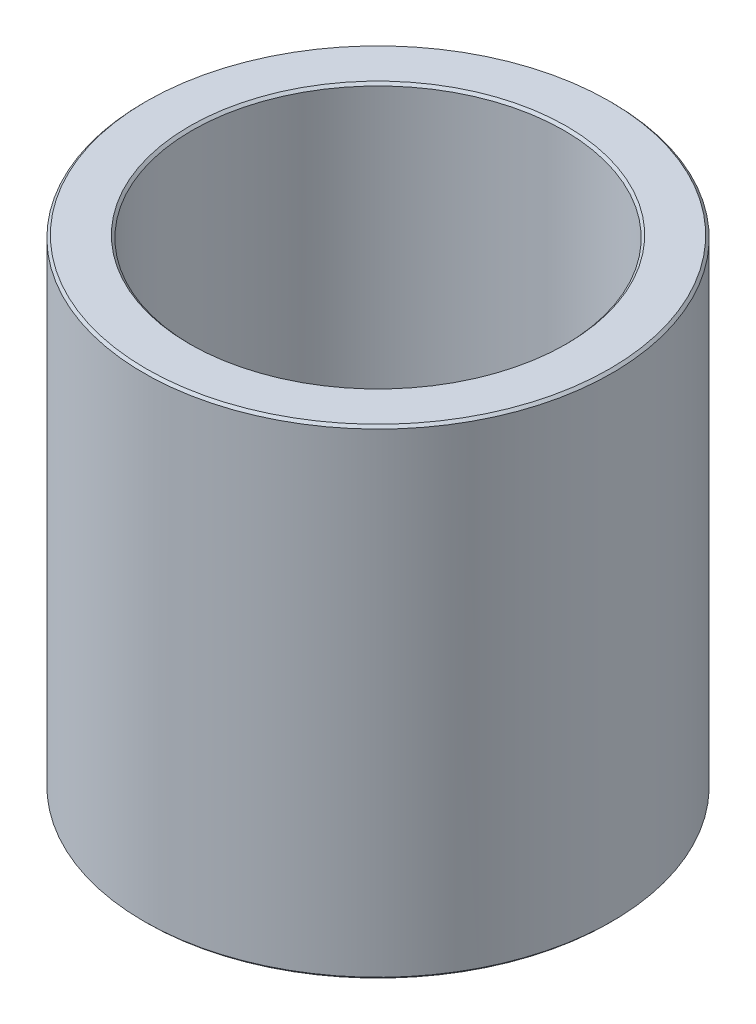
ISO-10303-21;
HEADER;
FILE_DESCRIPTION(('STEP AP214'),'2;1');
FILE_NAME('part.step','',(''),(''),'','','');
FILE_SCHEMA(('AUTOMOTIVE_DESIGN { 1 0 10303 214 1 1 1 1 }'));
ENDSEC;
DATA;
#1=APPLICATION_CONTEXT('core data for automotive mechanical design processes');
#2=APPLICATION_PROTOCOL_DEFINITION('international standard','automotive_design',2000,#1);
#3=PRODUCT_CONTEXT('',#1,'mechanical');
#4=PRODUCT('Part','Part','',(#3));
#5=PRODUCT_RELATED_PRODUCT_CATEGORY('part','',(#4));
#6=PRODUCT_DEFINITION_FORMATION('','',#4);
#7=PRODUCT_DEFINITION_CONTEXT('part definition',#1,'design');
#8=PRODUCT_DEFINITION('design','',#6,#7);
#9=PRODUCT_DEFINITION_SHAPE('','',#8);
#10=(LENGTH_UNIT() NAMED_UNIT(*) SI_UNIT(.MILLI.,.METRE.));
#11=(NAMED_UNIT(*) PLANE_ANGLE_UNIT() SI_UNIT($,.RADIAN.));
#12=(NAMED_UNIT(*) SI_UNIT($,.STERADIAN.) SOLID_ANGLE_UNIT());
#13=UNCERTAINTY_MEASURE_WITH_UNIT(LENGTH_MEASURE(1.E-05),#10,'distance_accuracy_value','');
#14=(GEOMETRIC_REPRESENTATION_CONTEXT(3) GLOBAL_UNCERTAINTY_ASSIGNED_CONTEXT((#13)) GLOBAL_UNIT_ASSIGNED_CONTEXT((#10,
#11,#12)) REPRESENTATION_CONTEXT('',''));
#15=CARTESIAN_POINT('',(0.,0.,0.));
#16=DIRECTION('',(0.,0.,1.));
#17=DIRECTION('',(1.,0.,0.));
#18=AXIS2_PLACEMENT_3D('',#15,#16,#17);
#19=CARTESIAN_POINT('',(0.,107.535181572289,0.));
#20=DIRECTION('',(0.,-1.,0.));
#21=DIRECTION('',(0.,0.,-1.));
#22=AXIS2_PLACEMENT_3D('',#19,#20,#21);
#23=CYLINDRICAL_SURFACE('',#22,52.5);
#24=CARTESIAN_POINT('',(0.,0.553045640529493,0.));
#25=DIRECTION('',(0.,1.,0.));
#26=DIRECTION('',(0.,0.,1.));
#27=AXIS2_PLACEMENT_3D('',#24,#25,#26);
#28=CIRCLE('',#27,52.5);
#29=CARTESIAN_POINT('',(0.,0.553045640529493,-52.5));
#30=VERTEX_POINT('',#29);
#31=EDGE_CURVE('E10',#30,#30,#28,.T.);
#32=CARTESIAN_POINT('',(0.,106.982135931759,0.));
#33=DIRECTION('',(0.,1.,0.));
#34=DIRECTION('',(0.,0.,1.));
#35=AXIS2_PLACEMENT_3D('',#32,#33,#34);
#36=CIRCLE('',#35,52.5);
#37=CARTESIAN_POINT('',(0.,106.982135931759,-52.5));
#38=VERTEX_POINT('',#37);
#39=EDGE_CURVE('E50',#38,#38,#36,.F.);
#40=CARTESIAN_POINT('',(0.,0.553045640529493,-52.5));
#41=CARTESIAN_POINT('',(0.,1.66168199772981,-52.5));
#42=CARTESIAN_POINT('',(0.,2.77031835493012,-52.5));
#43=CARTESIAN_POINT('',(0.,4.98759106933074,-52.5));
#44=CARTESIAN_POINT('',(0.,6.09622742653104,-52.5));
#45=CARTESIAN_POINT('',(0.,8.31350014093166,-52.5));
#46=CARTESIAN_POINT('',(0.,9.42213649813196,-52.5));
#47=CARTESIAN_POINT('',(0.,11.6394092125326,-52.5));
#48=CARTESIAN_POINT('',(0.,12.7480455697329,-52.5));
#49=CARTESIAN_POINT('',(0.,14.9653182841335,-52.5));
#50=CARTESIAN_POINT('',(0.,16.0739546413338,-52.5));
#51=CARTESIAN_POINT('',(0.,18.2912273557344,-52.5));
#52=CARTESIAN_POINT('',(0.,19.3998637129348,-52.5));
#53=CARTESIAN_POINT('',(0.,21.6171364273354,-52.5));
#54=CARTESIAN_POINT('',(0.,22.7257727845357,-52.5));
#55=CARTESIAN_POINT('',(0.,24.9430454989363,-52.5));
#56=CARTESIAN_POINT('',(0.,26.0516818561366,-52.5));
#57=CARTESIAN_POINT('',(0.,28.2689545705372,-52.5));
#58=CARTESIAN_POINT('',(0.,29.3775909277375,-52.5));
#59=CARTESIAN_POINT('',(0.,31.5948636421382,-52.5));
#60=CARTESIAN_POINT('',(0.,32.7034999993385,-52.5));
#61=CARTESIAN_POINT('',(0.,34.9207727137391,-52.5));
#62=CARTESIAN_POINT('',(0.,36.0294090709394,-52.5));
#63=CARTESIAN_POINT('',(0.,38.24668178534,-52.5));
#64=CARTESIAN_POINT('',(0.,39.3553181425403,-52.5));
#65=CARTESIAN_POINT('',(0.,41.5725908569409,-52.5));
#66=CARTESIAN_POINT('',(0.,42.6812272141413,-52.5));
#67=CARTESIAN_POINT('',(0.,44.8984999285419,-52.5));
#68=CARTESIAN_POINT('',(0.,46.0071362857422,-52.5));
#69=CARTESIAN_POINT('',(0.,48.2244090001428,-52.5));
#70=CARTESIAN_POINT('',(0.,49.3330453573431,-52.5));
#71=CARTESIAN_POINT('',(0.,51.5503180717437,-52.5));
#72=CARTESIAN_POINT('',(0.,52.658954428944,-52.5));
#73=CARTESIAN_POINT('',(0.,54.8762271433447,-52.5));
#74=CARTESIAN_POINT('',(0.,55.984863500545,-52.5));
#75=CARTESIAN_POINT('',(0.,58.2021362149456,-52.5));
#76=CARTESIAN_POINT('',(0.,59.3107725721459,-52.5));
#77=CARTESIAN_POINT('',(0.,61.5280452865465,-52.5));
#78=CARTESIAN_POINT('',(0.,62.6366816437468,-52.5));
#79=CARTESIAN_POINT('',(0.,64.8539543581474,-52.5));
#80=CARTESIAN_POINT('',(0.,65.9625907153478,-52.5));
#81=CARTESIAN_POINT('',(0.,68.1798634297484,-52.5));
#82=CARTESIAN_POINT('',(0.,69.2884997869487,-52.5));
#83=CARTESIAN_POINT('',(0.,71.5057725013493,-52.5));
#84=CARTESIAN_POINT('',(0.,72.6144088585496,-52.5));
#85=CARTESIAN_POINT('',(0.,74.8316815729502,-52.5));
#86=CARTESIAN_POINT('',(0.,75.9403179301505,-52.5));
#87=CARTESIAN_POINT('',(0.,78.1575906445511,-52.5));
#88=CARTESIAN_POINT('',(0.,79.2662270017515,-52.5));
#89=CARTESIAN_POINT('',(0.,81.4834997161521,-52.5));
#90=CARTESIAN_POINT('',(0.,82.5921360733524,-52.5));
#91=CARTESIAN_POINT('',(0.,84.809408787753,-52.5));
#92=CARTESIAN_POINT('',(0.,85.9180451449533,-52.5));
#93=CARTESIAN_POINT('',(0.,88.1353178593539,-52.5));
#94=CARTESIAN_POINT('',(0.,89.2439542165542,-52.5));
#95=CARTESIAN_POINT('',(0.,91.4612269309549,-52.5));
#96=CARTESIAN_POINT('',(0.,92.5698632881552,-52.5));
#97=CARTESIAN_POINT('',(0.,94.7871360025558,-52.5));
#98=CARTESIAN_POINT('',(0.,95.8957723597561,-52.5));
#99=CARTESIAN_POINT('',(0.,98.1130450741567,-52.5));
#100=CARTESIAN_POINT('',(0.,99.221681431357,-52.5));
#101=CARTESIAN_POINT('',(0.,101.438954145758,-52.5));
#102=CARTESIAN_POINT('',(0.,102.547590502958,-52.5));
#103=CARTESIAN_POINT('',(0.,104.764863217359,-52.5));
#104=CARTESIAN_POINT('',(0.,105.873499574559,-52.5));
#105=CARTESIAN_POINT('',(0.,106.982135931759,-52.5));
#106=B_SPLINE_CURVE_WITH_KNOTS('',3,(#40,#41,#42,#43,#44,#45,#46,#47,#48,#49,#50,#51,#52,#53,
#54,#55,#56,#57,#58,#59,#60,#61,#62,#63,#64,#65,#66,#67,#68,#69,#70,#71,#72,#73,#74,#75,#76,#77,
#78,#79,#80,#81,#82,#83,#84,#85,#86,#87,#88,#89,#90,#91,#92,#93,#94,#95,#96,#97,#98,#99,#100,
#101,#102,#103,#104,#105),.UNSPECIFIED.,.F.,.F.,(4,2,2,2,2,2,2,2,2,2,2,2,2,2,2,2,2,2,2,2,2,2,2,
2,2,2,2,2,2,2,2,2,4),(0.,3.32590907160094,6.65181814320186,9.97772721480278,13.3036362864037,
16.6295453580046,19.9554544296056,23.2813635012065,26.6072725728074,29.9331816444084,
33.2590907160093,36.5849997876102,39.9109088592111,43.2368179308121,46.562727002413,
49.8886360740139,53.2145451456148,56.5404542172158,59.8663632888167,63.1922723604176,
66.5181814320186,69.8440905036195,73.1699995752204,76.4959086468213,79.8218177184223,
83.1477267900232,86.4736358616241,89.7995449332251,93.125454004826,96.4513630764269,
99.7772721480278,103.103181219629,106.42909029123),.UNSPECIFIED.);
#107=EDGE_CURVE('BSEAM39',#30,#38,#106,.T.);
#108=ORIENTED_EDGE('',*,*,#31,.T.);
#109=ORIENTED_EDGE('',*,*,#39,.T.);
#110=ORIENTED_EDGE('',*,*,#107,.T.);
#111=ORIENTED_EDGE('',*,*,#107,.F.);
#112=EDGE_LOOP('',(#108,#110,#109,#111));
#113=FACE_BOUND('',#112,.T.);
#114=ADVANCED_FACE('F39',(#113),#23,.T.);
#115=CARTESIAN_POINT('',(0.,107.535181572289,0.));
#116=DIRECTION('',(0.,1.,0.));
#117=DIRECTION('',(0.,0.,1.));
#118=AXIS2_PLACEMENT_3D('',#115,#116,#117);
#119=PLANE('',#118);
#120=CARTESIAN_POINT('',(0.,107.535181572289,0.));
#121=DIRECTION('',(0.,1.,0.));
#122=DIRECTION('',(0.,0.,1.));
#123=AXIS2_PLACEMENT_3D('',#120,#121,#122);
#124=CIRCLE('',#123,42.2751699766673);
#125=CARTESIAN_POINT('',(0.,107.535181572289,42.2751699766673));
#126=VERTEX_POINT('',#125);
#127=EDGE_CURVE('E58',#126,#126,#124,.F.);
#128=ORIENTED_EDGE('',*,*,#127,.T.);
#129=EDGE_LOOP('',(#128));
#130=FACE_BOUND('',#129,.T.);
#131=CARTESIAN_POINT('',(0.,107.535181572289,0.));
#132=DIRECTION('',(0.,1.,0.));
#133=DIRECTION('',(0.,0.,1.));
#134=AXIS2_PLACEMENT_3D('',#131,#132,#133);
#135=CIRCLE('',#134,51.9469543594707);
#136=CARTESIAN_POINT('',(0.,107.535181572289,51.9469543594707));
#137=VERTEX_POINT('',#136);
#138=EDGE_CURVE('E61',#137,#137,#135,.T.);
#139=ORIENTED_EDGE('',*,*,#138,.T.);
#140=EDGE_LOOP('',(#139));
#141=FACE_BOUND('',#140,.T.);
#142=ADVANCED_FACE('F88',(#130,#141),#119,.T.);
#143=CARTESIAN_POINT('',(0.,0.,0.));
#144=DIRECTION('',(0.,1.,0.));
#145=DIRECTION('',(0.,0.,1.));
#146=AXIS2_PLACEMENT_3D('',#143,#144,#145);
#147=PLANE('',#146);
#148=CARTESIAN_POINT('',(0.,0.,0.));
#149=DIRECTION('',(0.,1.,0.));
#150=DIRECTION('',(0.,0.,1.));
#151=AXIS2_PLACEMENT_3D('',#148,#149,#150);
#152=CIRCLE('',#151,42.2751699766672);
#153=CARTESIAN_POINT('',(0.,0.,42.2751699766672));
#154=VERTEX_POINT('',#153);
#155=EDGE_CURVE('E51',#154,#154,#152,.T.);
#156=ORIENTED_EDGE('',*,*,#155,.T.);
#157=EDGE_LOOP('',(#156));
#158=FACE_BOUND('',#157,.T.);
#159=CARTESIAN_POINT('',(0.,0.,0.));
#160=DIRECTION('',(0.,1.,0.));
#161=DIRECTION('',(0.,0.,1.));
#162=AXIS2_PLACEMENT_3D('',#159,#160,#161);
#163=CIRCLE('',#162,51.9469543594705);
#164=CARTESIAN_POINT('',(0.,0.,51.9469543594705));
#165=VERTEX_POINT('',#164);
#166=EDGE_CURVE('E54',#165,#165,#163,.F.);
#167=ORIENTED_EDGE('',*,*,#166,.T.);
#168=EDGE_LOOP('',(#167));
#169=FACE_BOUND('',#168,.T.);
#170=ADVANCED_FACE('F83',(#158,#169),#147,.F.);
#171=CARTESIAN_POINT('',(0.,107.535181572289,0.));
#172=DIRECTION('',(0.,-1.,0.));
#173=DIRECTION('',(0.,0.,-1.));
#174=AXIS2_PLACEMENT_3D('',#171,#172,#173);
#175=CYLINDRICAL_SURFACE('',#174,41.7221243361379);
#176=CARTESIAN_POINT('',(0.,106.982135931759,0.));
#177=DIRECTION('',(0.,1.,0.));
#178=DIRECTION('',(0.,0.,1.));
#179=AXIS2_PLACEMENT_3D('',#176,#177,#178);
#180=CIRCLE('',#179,41.7221243361379);
#181=CARTESIAN_POINT('',(0.,106.982135931759,-41.7221243361379));
#182=VERTEX_POINT('',#181);
#183=EDGE_CURVE('E67',#182,#182,#180,.T.);
#184=CARTESIAN_POINT('',(0.,0.553045640529312,0.));
#185=DIRECTION('',(0.,1.,0.));
#186=DIRECTION('',(0.,0.,1.));
#187=AXIS2_PLACEMENT_3D('',#184,#185,#186);
#188=CIRCLE('',#187,41.7221243361379);
#189=CARTESIAN_POINT('',(0.,0.553045640529298,-41.7221243361379));
#190=VERTEX_POINT('',#189);
#191=EDGE_CURVE('E69',#190,#190,#188,.F.);
#192=CARTESIAN_POINT('',(0.,106.982135931759,-41.7221243361379));
#193=CARTESIAN_POINT('',(0.,105.873499574559,-41.7221243361379));
#194=CARTESIAN_POINT('',(0.,104.764863217358,-41.7221243361379));
#195=CARTESIAN_POINT('',(0.,102.547590502958,-41.7221243361379));
#196=CARTESIAN_POINT('',(0.,101.438954145757,-41.7221243361379));
#197=CARTESIAN_POINT('',(0.,99.2216814313569,-41.7221243361379));
#198=CARTESIAN_POINT('',(0.,98.1130450741566,-41.7221243361379));
#199=CARTESIAN_POINT('',(0.,95.895772359756,-41.7221243361379));
#200=CARTESIAN_POINT('',(0.,94.7871360025556,-41.7221243361379));
#201=CARTESIAN_POINT('',(0.,92.569863288155,-41.7221243361379));
#202=CARTESIAN_POINT('',(0.,91.4612269309547,-41.7221243361379));
#203=CARTESIAN_POINT('',(0.,89.2439542165541,-41.7221243361379));
#204=CARTESIAN_POINT('',(0.,88.1353178593538,-41.7221243361379));
#205=CARTESIAN_POINT('',(0.,85.9180451449532,-41.7221243361379));
#206=CARTESIAN_POINT('',(0.,84.8094087877528,-41.7221243361379));
#207=CARTESIAN_POINT('',(0.,82.5921360733522,-41.7221243361379));
#208=CARTESIAN_POINT('',(0.,81.4834997161519,-41.7221243361379));
#209=CARTESIAN_POINT('',(0.,79.2662270017513,-41.7221243361379));
#210=CARTESIAN_POINT('',(0.,78.157590644551,-41.7221243361379));
#211=CARTESIAN_POINT('',(0.,75.9403179301504,-41.7221243361379));
#212=CARTESIAN_POINT('',(0.,74.8316815729501,-41.7221243361379));
#213=CARTESIAN_POINT('',(0.,72.6144088585494,-41.7221243361379));
#214=CARTESIAN_POINT('',(0.,71.5057725013491,-41.7221243361379));
#215=CARTESIAN_POINT('',(0.,69.2884997869485,-41.7221243361379));
#216=CARTESIAN_POINT('',(0.,68.1798634297482,-41.7221243361379));
#217=CARTESIAN_POINT('',(0.,65.9625907153476,-41.7221243361379));
#218=CARTESIAN_POINT('',(0.,64.8539543581473,-41.7221243361379));
#219=CARTESIAN_POINT('',(0.,62.6366816437467,-41.7221243361379));
#220=CARTESIAN_POINT('',(0.,61.5280452865463,-41.7221243361379));
#221=CARTESIAN_POINT('',(0.,59.3107725721457,-41.7221243361379));
#222=CARTESIAN_POINT('',(0.,58.2021362149454,-41.7221243361379));
#223=CARTESIAN_POINT('',(0.,55.9848635005448,-41.7221243361379));
#224=CARTESIAN_POINT('',(0.,54.8762271433445,-41.7221243361379));
#225=CARTESIAN_POINT('',(0.,52.6589544289439,-41.7221243361379));
#226=CARTESIAN_POINT('',(0.,51.5503180717435,-41.7221243361379));
#227=CARTESIAN_POINT('',(0.,49.3330453573429,-41.7221243361379));
#228=CARTESIAN_POINT('',(0.,48.2244090001426,-41.7221243361379));
#229=CARTESIAN_POINT('',(0.,46.007136285742,-41.7221243361379));
#230=CARTESIAN_POINT('',(0.,44.8984999285417,-41.7221243361379));
#231=CARTESIAN_POINT('',(0.,42.6812272141411,-41.7221243361379));
#232=CARTESIAN_POINT('',(0.,41.5725908569408,-41.7221243361379));
#233=CARTESIAN_POINT('',(0.,39.3553181425402,-41.7221243361379));
#234=CARTESIAN_POINT('',(0.,38.2466817853398,-41.7221243361379));
#235=CARTESIAN_POINT('',(0.,36.0294090709392,-41.7221243361379));
#236=CARTESIAN_POINT('',(0.,34.9207727137389,-41.7221243361379));
#237=CARTESIAN_POINT('',(0.,32.7034999993383,-41.7221243361379));
#238=CARTESIAN_POINT('',(0.,31.594863642138,-41.7221243361379));
#239=CARTESIAN_POINT('',(0.,29.3775909277374,-41.7221243361379));
#240=CARTESIAN_POINT('',(0.,28.268954570537,-41.7221243361379));
#241=CARTESIAN_POINT('',(0.,26.0516818561364,-41.7221243361379));
#242=CARTESIAN_POINT('',(0.,24.9430454989361,-41.7221243361379));
#243=CARTESIAN_POINT('',(0.,22.7257727845355,-41.7221243361379));
#244=CARTESIAN_POINT('',(0.,21.6171364273352,-41.7221243361379));
#245=CARTESIAN_POINT('',(0.,19.3998637129346,-41.7221243361379));
#246=CARTESIAN_POINT('',(0.,18.2912273557343,-41.7221243361379));
#247=CARTESIAN_POINT('',(0.,16.0739546413336,-41.7221243361379));
#248=CARTESIAN_POINT('',(0.,14.9653182841333,-41.7221243361379));
#249=CARTESIAN_POINT('',(0.,12.7480455697327,-41.7221243361379));
#250=CARTESIAN_POINT('',(0.,11.6394092125324,-41.7221243361379));
#251=CARTESIAN_POINT('',(0.,9.42213649813177,-41.7221243361379));
#252=CARTESIAN_POINT('',(0.,8.31350014093145,-41.7221243361379));
#253=CARTESIAN_POINT('',(0.,6.09622742653084,-41.7221243361379));
#254=CARTESIAN_POINT('',(0.,4.98759106933054,-41.7221243361379));
#255=CARTESIAN_POINT('',(0.,2.77031835492992,-41.7221243361379));
#256=CARTESIAN_POINT('',(0.,1.66168199772961,-41.7221243361379));
#257=CARTESIAN_POINT('',(0.,0.553045640529298,-41.7221243361379));
#258=B_SPLINE_CURVE_WITH_KNOTS('',3,(#192,#193,#194,#195,#196,#197,#198,#199,#200,#201,#202,
#203,#204,#205,#206,#207,#208,#209,#210,#211,#212,#213,#214,#215,#216,#217,#218,#219,#220,#221,
#222,#223,#224,#225,#226,#227,#228,#229,#230,#231,#232,#233,#234,#235,#236,#237,#238,#239,#240,
#241,#242,#243,#244,#245,#246,#247,#248,#249,#250,#251,#252,#253,#254,#255,#256,#257),
.UNSPECIFIED.,.F.,.F.,(4,2,2,2,2,2,2,2,2,2,2,2,2,2,2,2,2,2,2,2,2,2,2,2,2,2,2,2,2,2,2,2,4),(0.,
3.32590907160094,6.65181814320187,9.97772721480279,13.3036362864037,16.6295453580046,
19.9554544296056,23.2813635012065,26.6072725728074,29.9331816444084,33.2590907160093,
36.5849997876102,39.9109088592112,43.2368179308121,46.562727002413,49.888636074014,
53.2145451456149,56.5404542172158,59.8663632888167,63.1922723604177,66.5181814320186,
69.8440905036195,73.1699995752205,76.4959086468214,79.8218177184223,83.1477267900233,
86.4736358616242,89.7995449332251,93.125454004826,96.451363076427,99.7772721480279,
103.103181219629,106.42909029123),.UNSPECIFIED.);
#259=EDGE_CURVE('BSEAM71',#182,#190,#258,.T.);
#260=ORIENTED_EDGE('',*,*,#183,.T.);
#261=ORIENTED_EDGE('',*,*,#191,.T.);
#262=ORIENTED_EDGE('',*,*,#259,.T.);
#263=ORIENTED_EDGE('',*,*,#259,.F.);
#264=EDGE_LOOP('',(#260,#262,#261,#263));
#265=FACE_BOUND('',#264,.T.);
#266=ADVANCED_FACE('F71',(#265),#175,.F.);
#267=CARTESIAN_POINT('',(0.,106.982135931759,0.));
#268=DIRECTION('',(0.,1.,0.));
#269=DIRECTION('',(0.,0.,1.));
#270=AXIS2_PLACEMENT_3D('',#267,#268,#269);
#271=CONICAL_SURFACE('',#270,41.7221243361379,0.785398163397455);
#272=ORIENTED_EDGE('',*,*,#127,.F.);
#273=EDGE_LOOP('',(#272));
#274=FACE_BOUND('',#273,.T.);
#275=ORIENTED_EDGE('',*,*,#183,.F.);
#276=EDGE_LOOP('',(#275));
#277=FACE_BOUND('',#276,.T.);
#278=ADVANCED_FACE('F77',(#274,#277),#271,.F.);
#279=CARTESIAN_POINT('',(0.,0.,0.));
#280=DIRECTION('',(0.,-1.,0.));
#281=DIRECTION('',(0.,0.,-1.));
#282=AXIS2_PLACEMENT_3D('',#279,#280,#281);
#283=CONICAL_SURFACE('',#282,42.2751699766672,0.785398163397455);
#284=ORIENTED_EDGE('',*,*,#191,.F.);
#285=EDGE_LOOP('',(#284));
#286=FACE_BOUND('',#285,.T.);
#287=ORIENTED_EDGE('',*,*,#155,.F.);
#288=EDGE_LOOP('',(#287));
#289=FACE_BOUND('',#288,.T.);
#290=ADVANCED_FACE('F73',(#286,#289),#283,.F.);
#291=CARTESIAN_POINT('',(0.,0.553045640529493,0.));
#292=DIRECTION('',(0.,1.,0.));
#293=DIRECTION('',(0.,0.,1.));
#294=AXIS2_PLACEMENT_3D('',#291,#292,#293);
#295=CONICAL_SURFACE('',#294,52.5,0.785398163397455);
#296=ORIENTED_EDGE('',*,*,#166,.F.);
#297=EDGE_LOOP('',(#296));
#298=FACE_BOUND('',#297,.T.);
#299=ORIENTED_EDGE('',*,*,#31,.F.);
#300=EDGE_LOOP('',(#299));
#301=FACE_BOUND('',#300,.T.);
#302=ADVANCED_FACE('F76',(#298,#301),#295,.T.);
#303=CARTESIAN_POINT('',(0.,107.535181572289,0.));
#304=DIRECTION('',(0.,-1.,0.));
#305=DIRECTION('',(0.,0.,-1.));
#306=AXIS2_PLACEMENT_3D('',#303,#304,#305);
#307=CONICAL_SURFACE('',#306,51.9469543594707,0.785398163397436);
#308=ORIENTED_EDGE('',*,*,#39,.F.);
#309=EDGE_LOOP('',(#308));
#310=FACE_BOUND('',#309,.T.);
#311=ORIENTED_EDGE('',*,*,#138,.F.);
#312=EDGE_LOOP('',(#311));
#313=FACE_BOUND('',#312,.T.);
#314=ADVANCED_FACE('F45',(#310,#313),#307,.T.);
#315=CLOSED_SHELL('',(#114,#142,#170,#266,#278,#290,#302,#314));
#316=MANIFOLD_SOLID_BREP('B2',#315);
#317=ADVANCED_BREP_SHAPE_REPRESENTATION('',(#18,#316),#14);
#318=SHAPE_DEFINITION_REPRESENTATION(#9,#317);
ENDSEC;
END-ISO-10303-21;
